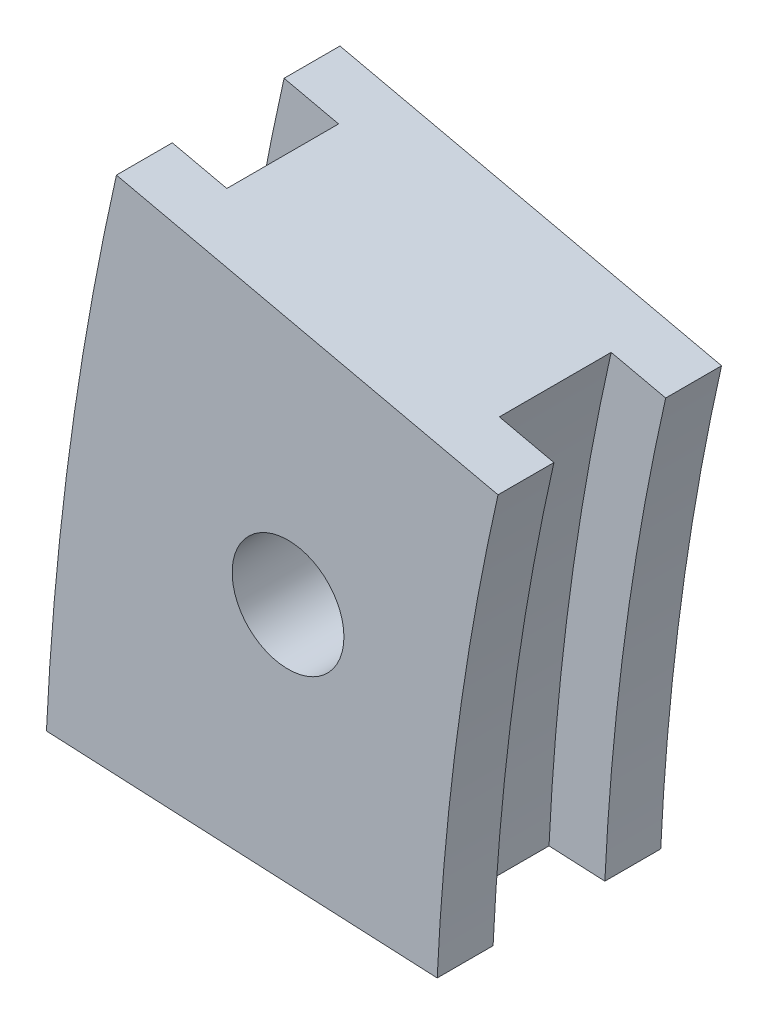
ISO-10303-21;
HEADER;
FILE_DESCRIPTION(('STEP AP214'),'2;1');
FILE_NAME('part.step','',(''),(''),'','','');
FILE_SCHEMA(('AUTOMOTIVE_DESIGN { 1 0 10303 214 1 1 1 1 }'));
ENDSEC;
DATA;
#1=APPLICATION_CONTEXT('core data for automotive mechanical design processes');
#2=APPLICATION_PROTOCOL_DEFINITION('international standard','automotive_design',2000,#1);
#3=PRODUCT_CONTEXT('',#1,'mechanical');
#4=PRODUCT('Part','Part','',(#3));
#5=PRODUCT_RELATED_PRODUCT_CATEGORY('part','',(#4));
#6=PRODUCT_DEFINITION_FORMATION('','',#4);
#7=PRODUCT_DEFINITION_CONTEXT('part definition',#1,'design');
#8=PRODUCT_DEFINITION('design','',#6,#7);
#9=PRODUCT_DEFINITION_SHAPE('','',#8);
#10=(LENGTH_UNIT() NAMED_UNIT(*) SI_UNIT(.MILLI.,.METRE.));
#11=(NAMED_UNIT(*) PLANE_ANGLE_UNIT() SI_UNIT($,.RADIAN.));
#12=(NAMED_UNIT(*) SI_UNIT($,.STERADIAN.) SOLID_ANGLE_UNIT());
#13=UNCERTAINTY_MEASURE_WITH_UNIT(LENGTH_MEASURE(1.E-05),#10,'distance_accuracy_value','');
#14=(GEOMETRIC_REPRESENTATION_CONTEXT(3) GLOBAL_UNCERTAINTY_ASSIGNED_CONTEXT((#13)) GLOBAL_UNIT_ASSIGNED_CONTEXT((#10,
#11,#12)) REPRESENTATION_CONTEXT('',''));
#15=CARTESIAN_POINT('',(0.,0.,0.));
#16=DIRECTION('',(0.,0.,1.));
#17=DIRECTION('',(1.,0.,0.));
#18=AXIS2_PLACEMENT_3D('',#15,#16,#17);
#19=CARTESIAN_POINT('',(0.,0.,4.));
#20=DIRECTION('',(0.,0.,-1.));
#21=DIRECTION('',(-1.,0.,0.));
#22=AXIS2_PLACEMENT_3D('',#19,#20,#21);
#23=CYLINDRICAL_SURFACE('',#22,93.);
#24=CARTESIAN_POINT('',(0.,0.,-2.));
#25=DIRECTION('',(0.,0.,1.));
#26=DIRECTION('',(1.,0.,0.));
#27=AXIS2_PLACEMENT_3D('',#24,#25,#26);
#28=CIRCLE('',#27,93.);
#29=CARTESIAN_POINT('',(-92.8954467947478,4.40862391276168,-2.));
#30=VERTEX_POINT('',#29);
#31=CARTESIAN_POINT('',(-90.7186067145308,20.4727720588661,-2.));
#32=VERTEX_POINT('',#31);
#33=EDGE_CURVE('E46',#30,#32,#28,.F.);
#34=ORIENTED_EDGE('',*,*,#33,.F.);
#35=DIRECTION('',(0.,0.,-1.));
#36=VECTOR('',#35,1.);
#37=CARTESIAN_POINT('',(-92.8954467947478,4.40862391276169,4.));
#38=LINE('',#37,#36);
#39=CARTESIAN_POINT('',(-92.8954467947478,4.40862391276169,-4.));
#40=VERTEX_POINT('',#39);
#41=EDGE_CURVE('E197',#30,#40,#38,.T.);
#42=ORIENTED_EDGE('',*,*,#41,.T.);
#43=CARTESIAN_POINT('',(0.,0.,-4.));
#44=DIRECTION('',(0.,0.,-1.));
#45=DIRECTION('',(1.,0.,0.));
#46=AXIS2_PLACEMENT_3D('',#43,#44,#45);
#47=CIRCLE('',#46,93.);
#48=CARTESIAN_POINT('',(-90.7186067145308,20.4727720588661,-4.));
#49=VERTEX_POINT('',#48);
#50=EDGE_CURVE('E186',#40,#49,#47,.T.);
#51=ORIENTED_EDGE('',*,*,#50,.T.);
#52=DIRECTION('',(0.,0.,-1.));
#53=VECTOR('',#52,1.);
#54=CARTESIAN_POINT('',(-90.7186067145308,20.4727720588661,4.));
#55=LINE('',#54,#53);
#56=EDGE_CURVE('E194',#32,#49,#55,.T.);
#57=ORIENTED_EDGE('',*,*,#56,.F.);
#58=EDGE_LOOP('',(#34,#42,#51,#57));
#59=FACE_BOUND('',#58,.T.);
#60=ADVANCED_FACE('F31',(#59),#23,.F.);
#61=CARTESIAN_POINT('',(0.,0.,4.));
#62=DIRECTION('',(0.,0.,-1.));
#63=DIRECTION('',(-1.,0.,0.));
#64=AXIS2_PLACEMENT_3D('',#61,#62,#63);
#65=CYLINDRICAL_SURFACE('',#64,107.);
#66=CARTESIAN_POINT('',(0.,0.,-2.));
#67=DIRECTION('',(0.,0.,1.));
#68=DIRECTION('',(1.,0.,0.));
#69=AXIS2_PLACEMENT_3D('',#66,#67,#68);
#70=CIRCLE('',#69,107.);
#71=CARTESIAN_POINT('',(-104.375171166181,23.5546947343943,-2.));
#72=VERTEX_POINT('',#71);
#73=CARTESIAN_POINT('',(-106.879707602559,5.07228772758602,-2.));
#74=VERTEX_POINT('',#73);
#75=EDGE_CURVE('E146',#72,#74,#70,.T.);
#76=ORIENTED_EDGE('',*,*,#75,.F.);
#77=DIRECTION('',(0.,0.,-1.));
#78=VECTOR('',#77,1.);
#79=CARTESIAN_POINT('',(-104.375171166181,23.5546947343943,4.));
#80=LINE('',#79,#78);
#81=CARTESIAN_POINT('',(-104.375171166181,23.5546947343943,-4.));
#82=VERTEX_POINT('',#81);
#83=EDGE_CURVE('E180',#72,#82,#80,.T.);
#84=ORIENTED_EDGE('',*,*,#83,.T.);
#85=CARTESIAN_POINT('',(0.,0.,-4.));
#86=DIRECTION('',(0.,0.,1.));
#87=DIRECTION('',(1.,0.,0.));
#88=AXIS2_PLACEMENT_3D('',#85,#86,#87);
#89=CIRCLE('',#88,107.);
#90=CARTESIAN_POINT('',(-106.879707602559,5.07228772758602,-4.));
#91=VERTEX_POINT('',#90);
#92=EDGE_CURVE('E169',#82,#91,#89,.T.);
#93=ORIENTED_EDGE('',*,*,#92,.T.);
#94=DIRECTION('',(0.,0.,-1.));
#95=VECTOR('',#94,1.);
#96=CARTESIAN_POINT('',(-106.879707602559,5.07228772758602,4.));
#97=LINE('',#96,#95);
#98=EDGE_CURVE('E201',#74,#91,#97,.T.);
#99=ORIENTED_EDGE('',*,*,#98,.F.);
#100=EDGE_LOOP('',(#76,#84,#93,#99));
#101=FACE_BOUND('',#100,.T.);
#102=ADVANCED_FACE('F217',(#101),#65,.T.);
#103=CARTESIAN_POINT('',(-104.375171166181,23.5546947343943,4.));
#104=VERTEX_POINT('',#103);
#105=CARTESIAN_POINT('',(-104.375171166181,23.5546947343943,2.));
#106=VERTEX_POINT('',#105);
#107=EDGE_CURVE('E191',#104,#106,#80,.T.);
#108=ORIENTED_EDGE('',*,*,#107,.T.);
#109=CARTESIAN_POINT('',(0.,0.,2.));
#110=DIRECTION('',(0.,0.,1.));
#111=DIRECTION('',(1.,0.,0.));
#112=AXIS2_PLACEMENT_3D('',#109,#110,#111);
#113=CIRCLE('',#112,107.);
#114=CARTESIAN_POINT('',(-106.879707602559,5.07228772758602,2.));
#115=VERTEX_POINT('',#114);
#116=EDGE_CURVE('E153',#106,#115,#113,.T.);
#117=ORIENTED_EDGE('',*,*,#116,.T.);
#118=CARTESIAN_POINT('',(-106.879707602559,5.07228772758602,4.));
#119=VERTEX_POINT('',#118);
#120=EDGE_CURVE('E125',#119,#115,#97,.T.);
#121=ORIENTED_EDGE('',*,*,#120,.F.);
#122=CARTESIAN_POINT('',(0.,0.,4.));
#123=DIRECTION('',(0.,0.,1.));
#124=DIRECTION('',(1.,0.,0.));
#125=AXIS2_PLACEMENT_3D('',#122,#123,#124);
#126=CIRCLE('',#125,107.);
#127=EDGE_CURVE('E170',#104,#119,#126,.T.);
#128=ORIENTED_EDGE('',*,*,#127,.F.);
#129=EDGE_LOOP('',(#108,#117,#121,#128));
#130=FACE_BOUND('',#129,.T.);
#131=ADVANCED_FACE('F33',(#130),#65,.T.);
#132=CARTESIAN_POINT('',(-92.8954467947478,4.40862391276168,4.));
#133=DIRECTION('',(0.0474045582017385,0.998875771986536,0.));
#134=DIRECTION('',(-0.998875771986536,0.0474045582017385,0.));
#135=AXIS2_PLACEMENT_3D('',#132,#133,#134);
#136=PLANE('',#135);
#137=DIRECTION('',(0.,0.,-1.));
#138=VECTOR('',#137,1.);
#139=CARTESIAN_POINT('',(-94.8931983387209,4.50343302916516,2.));
#140=LINE('',#139,#138);
#141=CARTESIAN_POINT('',(-94.8931983387209,4.50343302916516,2.));
#142=VERTEX_POINT('',#141);
#143=CARTESIAN_POINT('',(-94.8931983387209,4.50343302916516,-2.));
#144=VERTEX_POINT('',#143);
#145=EDGE_CURVE('E131',#142,#144,#140,.T.);
#146=ORIENTED_EDGE('',*,*,#145,.F.);
#147=DIRECTION('',(0.998875771986536,-0.0474045582017385,0.));
#148=VECTOR('',#147,1.);
#149=CARTESIAN_POINT('',(-81.9921139469227,3.89117450506435,2.));
#150=LINE('',#149,#148);
#151=CARTESIAN_POINT('',(-92.8954467947478,4.40862391276168,2.));
#152=VERTEX_POINT('',#151);
#153=EDGE_CURVE('E140',#142,#152,#150,.T.);
#154=ORIENTED_EDGE('',*,*,#153,.T.);
#155=CARTESIAN_POINT('',(-92.8954467947478,4.40862391276169,4.));
#156=VERTEX_POINT('',#155);
#157=EDGE_CURVE('E198',#156,#152,#38,.T.);
#158=ORIENTED_EDGE('',*,*,#157,.F.);
#159=DIRECTION('',(0.998875771986536,-0.0474045582017385,0.));
#160=VECTOR('',#159,1.);
#161=CARTESIAN_POINT('',(-92.8954467947478,4.40862391276168,4.));
#162=LINE('',#161,#160);
#163=EDGE_CURVE('E173',#119,#156,#162,.T.);
#164=ORIENTED_EDGE('',*,*,#163,.F.);
#165=ORIENTED_EDGE('',*,*,#120,.T.);
#166=DIRECTION('',(0.998875771986536,-0.0474045582017385,0.));
#167=VECTOR('',#166,1.);
#168=CARTESIAN_POINT('',(-104.881956058586,4.97747861118255,2.));
#169=LINE('',#168,#167);
#170=CARTESIAN_POINT('',(-104.881956058586,4.97747861118256,2.));
#171=VERTEX_POINT('',#170);
#172=EDGE_CURVE('E156',#115,#171,#169,.T.);
#173=ORIENTED_EDGE('',*,*,#172,.T.);
#174=DIRECTION('',(0.,0.,-1.));
#175=VECTOR('',#174,1.);
#176=CARTESIAN_POINT('',(-104.881956058586,4.97747861118256,2.));
#177=LINE('',#176,#175);
#178=CARTESIAN_POINT('',(-104.881956058586,4.97747861118256,-2.));
#179=VERTEX_POINT('',#178);
#180=EDGE_CURVE('E166',#171,#179,#177,.T.);
#181=ORIENTED_EDGE('',*,*,#180,.T.);
#182=DIRECTION('',(0.998875771986536,-0.0474045582017385,0.));
#183=VECTOR('',#182,1.);
#184=CARTESIAN_POINT('',(-104.881956058586,4.97747861118255,-2.));
#185=LINE('',#184,#183);
#186=EDGE_CURVE('E148',#74,#179,#185,.T.);
#187=ORIENTED_EDGE('',*,*,#186,.F.);
#188=ORIENTED_EDGE('',*,*,#98,.T.);
#189=DIRECTION('',(0.998875771986536,-0.0474045582017385,0.));
#190=VECTOR('',#189,1.);
#191=CARTESIAN_POINT('',(-92.8954467947478,4.40862391276168,-4.));
#192=LINE('',#191,#190);
#193=EDGE_CURVE('E183',#91,#40,#192,.T.);
#194=ORIENTED_EDGE('',*,*,#193,.T.);
#195=ORIENTED_EDGE('',*,*,#41,.F.);
#196=DIRECTION('',(0.998875771986536,-0.0474045582017385,0.));
#197=VECTOR('',#196,1.);
#198=CARTESIAN_POINT('',(-81.9921139469227,3.89117450506435,-2.));
#199=LINE('',#198,#197);
#200=EDGE_CURVE('E132',#144,#30,#199,.T.);
#201=ORIENTED_EDGE('',*,*,#200,.F.);
#202=EDGE_LOOP('',(#146,#154,#158,#164,#165,#173,#181,#187,#188,#194,#195,#201));
#203=FACE_BOUND('',#202,.T.);
#204=ADVANCED_FACE('F208',(#203),#136,.F.);
#205=ORIENTED_EDGE('',*,*,#157,.T.);
#206=CARTESIAN_POINT('',(0.,0.,2.));
#207=DIRECTION('',(0.,0.,1.));
#208=DIRECTION('',(1.,0.,0.));
#209=AXIS2_PLACEMENT_3D('',#206,#207,#208);
#210=CIRCLE('',#209,93.);
#211=CARTESIAN_POINT('',(-90.7186067145308,20.4727720588661,2.));
#212=VERTEX_POINT('',#211);
#213=EDGE_CURVE('E138',#152,#212,#210,.F.);
#214=ORIENTED_EDGE('',*,*,#213,.T.);
#215=CARTESIAN_POINT('',(-90.7186067145308,20.4727720588661,4.));
#216=VERTEX_POINT('',#215);
#217=EDGE_CURVE('E195',#216,#212,#55,.T.);
#218=ORIENTED_EDGE('',*,*,#217,.F.);
#219=CARTESIAN_POINT('',(0.,0.,4.));
#220=DIRECTION('',(0.,0.,-1.));
#221=DIRECTION('',(1.,0.,0.));
#222=AXIS2_PLACEMENT_3D('',#219,#220,#221);
#223=CIRCLE('',#222,93.);
#224=EDGE_CURVE('E176',#156,#216,#223,.T.);
#225=ORIENTED_EDGE('',*,*,#224,.F.);
#226=EDGE_LOOP('',(#205,#214,#218,#225));
#227=FACE_BOUND('',#226,.T.);
#228=ADVANCED_FACE('F231',(#227),#23,.F.);
#229=CARTESIAN_POINT('',(-90.7186067145308,20.4727720588661,4.));
#230=DIRECTION('',(-0.220137333966302,-0.975468889403557,0.));
#231=DIRECTION('',(0.975468889403557,-0.220137333966302,0.));
#232=AXIS2_PLACEMENT_3D('',#229,#230,#231);
#233=PLANE('',#232);
#234=ORIENTED_EDGE('',*,*,#217,.T.);
#235=DIRECTION('',(-0.975468889403557,0.220137333966302,0.));
#236=VECTOR('',#235,1.);
#237=CARTESIAN_POINT('',(-90.7186067145308,20.4727720588661,2.));
#238=LINE('',#237,#236);
#239=CARTESIAN_POINT('',(-92.6695444933379,20.9130467267986,2.));
#240=VERTEX_POINT('',#239);
#241=EDGE_CURVE('E11',#212,#240,#238,.T.);
#242=ORIENTED_EDGE('',*,*,#241,.T.);
#243=DIRECTION('',(0.,0.,-1.));
#244=VECTOR('',#243,1.);
#245=CARTESIAN_POINT('',(-92.6695444933379,20.9130467267986,2.));
#246=LINE('',#245,#244);
#247=CARTESIAN_POINT('',(-92.6695444933379,20.9130467267986,-2.));
#248=VERTEX_POINT('',#247);
#249=EDGE_CURVE('E128',#240,#248,#246,.T.);
#250=ORIENTED_EDGE('',*,*,#249,.T.);
#251=DIRECTION('',(-0.975468889403557,0.220137333966302,0.));
#252=VECTOR('',#251,1.);
#253=CARTESIAN_POINT('',(-90.7186067145308,20.4727720588661,-2.));
#254=LINE('',#253,#252);
#255=EDGE_CURVE('E39',#32,#248,#254,.T.);
#256=ORIENTED_EDGE('',*,*,#255,.F.);
#257=ORIENTED_EDGE('',*,*,#56,.T.);
#258=DIRECTION('',(-0.975468889403557,0.220137333966302,0.));
#259=VECTOR('',#258,1.);
#260=CARTESIAN_POINT('',(-90.7186067145308,20.4727720588661,-4.));
#261=LINE('',#260,#259);
#262=EDGE_CURVE('E174',#49,#82,#261,.T.);
#263=ORIENTED_EDGE('',*,*,#262,.T.);
#264=ORIENTED_EDGE('',*,*,#83,.F.);
#265=DIRECTION('',(-0.975468889403557,0.220137333966301,0.));
#266=VECTOR('',#265,1.);
#267=CARTESIAN_POINT('',(-102.424233387373,23.1144200664617,-2.));
#268=LINE('',#267,#266);
#269=CARTESIAN_POINT('',(-102.424233387373,23.1144200664617,-2.));
#270=VERTEX_POINT('',#269);
#271=EDGE_CURVE('E151',#270,#72,#268,.T.);
#272=ORIENTED_EDGE('',*,*,#271,.F.);
#273=DIRECTION('',(0.,0.,-1.));
#274=VECTOR('',#273,1.);
#275=CARTESIAN_POINT('',(-102.424233387373,23.1144200664617,2.));
#276=LINE('',#275,#274);
#277=CARTESIAN_POINT('',(-102.424233387373,23.1144200664617,2.));
#278=VERTEX_POINT('',#277);
#279=EDGE_CURVE('E164',#278,#270,#276,.T.);
#280=ORIENTED_EDGE('',*,*,#279,.F.);
#281=DIRECTION('',(-0.975468889403557,0.220137333966301,0.));
#282=VECTOR('',#281,1.);
#283=CARTESIAN_POINT('',(-102.424233387373,23.1144200664617,2.));
#284=LINE('',#283,#282);
#285=EDGE_CURVE('E161',#278,#106,#284,.T.);
#286=ORIENTED_EDGE('',*,*,#285,.T.);
#287=ORIENTED_EDGE('',*,*,#107,.F.);
#288=DIRECTION('',(-0.975468889403557,0.220137333966302,0.));
#289=VECTOR('',#288,1.);
#290=CARTESIAN_POINT('',(-90.7186067145308,20.4727720588661,4.));
#291=LINE('',#290,#289);
#292=EDGE_CURVE('E178',#216,#104,#291,.T.);
#293=ORIENTED_EDGE('',*,*,#292,.F.);
#294=EDGE_LOOP('',(#234,#242,#250,#256,#257,#263,#264,#272,#280,#286,#287,#293));
#295=FACE_BOUND('',#294,.T.);
#296=ADVANCED_FACE('F136',(#295),#233,.F.);
#297=CARTESIAN_POINT('',(0.,0.,4.));
#298=DIRECTION('',(0.,0.,1.));
#299=DIRECTION('',(1.,0.,0.));
#300=AXIS2_PLACEMENT_3D('',#297,#298,#299);
#301=PLANE('',#300);
#302=CARTESIAN_POINT('',(-98.2335186274641,13.3115468448208,4.));
#303=DIRECTION('',(0.,0.,1.));
#304=DIRECTION('',(1.,0.,0.));
#305=AXIS2_PLACEMENT_3D('',#302,#303,#304);
#306=CIRCLE('',#305,2.);
#307=CARTESIAN_POINT('',(-96.2335186274641,13.3115468448208,4.));
#308=VERTEX_POINT('',#307);
#309=EDGE_CURVE('E365',#308,#308,#306,.T.);
#310=ORIENTED_EDGE('',*,*,#309,.F.);
#311=EDGE_LOOP('',(#310));
#312=FACE_BOUND('',#311,.T.);
#313=ORIENTED_EDGE('',*,*,#127,.T.);
#314=ORIENTED_EDGE('',*,*,#163,.T.);
#315=ORIENTED_EDGE('',*,*,#224,.T.);
#316=ORIENTED_EDGE('',*,*,#292,.T.);
#317=EDGE_LOOP('',(#313,#314,#315,#316));
#318=FACE_BOUND('',#317,.T.);
#319=ADVANCED_FACE('F235',(#312,#318),#301,.T.);
#320=CARTESIAN_POINT('',(0.,0.,-4.));
#321=DIRECTION('',(0.,0.,1.));
#322=DIRECTION('',(1.,0.,0.));
#323=AXIS2_PLACEMENT_3D('',#320,#321,#322);
#324=PLANE('',#323);
#325=CARTESIAN_POINT('',(-98.2335186274641,13.3115468448208,-4.));
#326=DIRECTION('',(0.,0.,1.));
#327=DIRECTION('',(1.,0.,0.));
#328=AXIS2_PLACEMENT_3D('',#325,#326,#327);
#329=CIRCLE('',#328,2.);
#330=CARTESIAN_POINT('',(-96.2335186274641,13.3115468448208,-4.));
#331=VERTEX_POINT('',#330);
#332=EDGE_CURVE('E133',#331,#331,#329,.T.);
#333=ORIENTED_EDGE('',*,*,#332,.T.);
#334=EDGE_LOOP('',(#333));
#335=FACE_BOUND('',#334,.T.);
#336=ORIENTED_EDGE('',*,*,#92,.F.);
#337=ORIENTED_EDGE('',*,*,#262,.F.);
#338=ORIENTED_EDGE('',*,*,#50,.F.);
#339=ORIENTED_EDGE('',*,*,#193,.F.);
#340=EDGE_LOOP('',(#336,#337,#338,#339));
#341=FACE_BOUND('',#340,.T.);
#342=ADVANCED_FACE('F215',(#335,#341),#324,.F.);
#343=CARTESIAN_POINT('',(0.,0.,2.));
#344=DIRECTION('',(0.,0.,-1.));
#345=DIRECTION('',(-1.,0.,0.));
#346=AXIS2_PLACEMENT_3D('',#343,#344,#345);
#347=CYLINDRICAL_SURFACE('',#346,105.);
#348=ORIENTED_EDGE('',*,*,#180,.F.);
#349=CARTESIAN_POINT('',(0.,0.,2.));
#350=DIRECTION('',(0.,0.,-1.));
#351=DIRECTION('',(1.,0.,0.));
#352=AXIS2_PLACEMENT_3D('',#349,#350,#351);
#353=CIRCLE('',#352,105.);
#354=EDGE_CURVE('E159',#171,#278,#353,.T.);
#355=ORIENTED_EDGE('',*,*,#354,.T.);
#356=ORIENTED_EDGE('',*,*,#279,.T.);
#357=CARTESIAN_POINT('',(0.,0.,-2.));
#358=DIRECTION('',(0.,0.,-1.));
#359=DIRECTION('',(1.,0.,0.));
#360=AXIS2_PLACEMENT_3D('',#357,#358,#359);
#361=CIRCLE('',#360,105.);
#362=EDGE_CURVE('E54',#179,#270,#361,.T.);
#363=ORIENTED_EDGE('',*,*,#362,.F.);
#364=EDGE_LOOP('',(#348,#355,#356,#363));
#365=FACE_BOUND('',#364,.T.);
#366=ADVANCED_FACE('F245',(#365),#347,.T.);
#367=CARTESIAN_POINT('',(0.,0.,2.));
#368=DIRECTION('',(0.,0.,1.));
#369=DIRECTION('',(1.,0.,0.));
#370=AXIS2_PLACEMENT_3D('',#367,#368,#369);
#371=PLANE('',#370);
#372=ORIENTED_EDGE('',*,*,#116,.F.);
#373=ORIENTED_EDGE('',*,*,#285,.F.);
#374=ORIENTED_EDGE('',*,*,#354,.F.);
#375=ORIENTED_EDGE('',*,*,#172,.F.);
#376=EDGE_LOOP('',(#372,#373,#374,#375));
#377=FACE_BOUND('',#376,.T.);
#378=ADVANCED_FACE('F241',(#377),#371,.F.);
#379=CARTESIAN_POINT('',(0.,0.,-2.));
#380=DIRECTION('',(0.,0.,1.));
#381=DIRECTION('',(1.,0.,0.));
#382=AXIS2_PLACEMENT_3D('',#379,#380,#381);
#383=PLANE('',#382);
#384=ORIENTED_EDGE('',*,*,#75,.T.);
#385=ORIENTED_EDGE('',*,*,#186,.T.);
#386=ORIENTED_EDGE('',*,*,#362,.T.);
#387=ORIENTED_EDGE('',*,*,#271,.T.);
#388=EDGE_LOOP('',(#384,#385,#386,#387));
#389=FACE_BOUND('',#388,.T.);
#390=ADVANCED_FACE('F246',(#389),#383,.T.);
#391=CARTESIAN_POINT('',(0.,0.,2.));
#392=DIRECTION('',(0.,0.,1.));
#393=DIRECTION('',(1.,0.,0.));
#394=AXIS2_PLACEMENT_3D('',#391,#392,#393);
#395=PLANE('',#394);
#396=ORIENTED_EDGE('',*,*,#153,.F.);
#397=CARTESIAN_POINT('',(0.,0.,2.));
#398=DIRECTION('',(0.,0.,1.));
#399=DIRECTION('',(1.,0.,0.));
#400=AXIS2_PLACEMENT_3D('',#397,#398,#399);
#401=CIRCLE('',#400,95.);
#402=EDGE_CURVE('E222',#240,#142,#401,.T.);
#403=ORIENTED_EDGE('',*,*,#402,.F.);
#404=ORIENTED_EDGE('',*,*,#241,.F.);
#405=ORIENTED_EDGE('',*,*,#213,.F.);
#406=EDGE_LOOP('',(#396,#403,#404,#405));
#407=FACE_BOUND('',#406,.T.);
#408=ADVANCED_FACE('F248',(#407),#395,.F.);
#409=CARTESIAN_POINT('',(0.,0.,-2.));
#410=DIRECTION('',(0.,0.,1.));
#411=DIRECTION('',(1.,0.,0.));
#412=AXIS2_PLACEMENT_3D('',#409,#410,#411);
#413=PLANE('',#412);
#414=ORIENTED_EDGE('',*,*,#33,.T.);
#415=ORIENTED_EDGE('',*,*,#255,.T.);
#416=CARTESIAN_POINT('',(0.,0.,-2.));
#417=DIRECTION('',(0.,0.,1.));
#418=DIRECTION('',(1.,0.,0.));
#419=AXIS2_PLACEMENT_3D('',#416,#417,#418);
#420=CIRCLE('',#419,95.);
#421=EDGE_CURVE('E120',#248,#144,#420,.T.);
#422=ORIENTED_EDGE('',*,*,#421,.T.);
#423=ORIENTED_EDGE('',*,*,#200,.T.);
#424=EDGE_LOOP('',(#414,#415,#422,#423));
#425=FACE_BOUND('',#424,.T.);
#426=ADVANCED_FACE('F119',(#425),#413,.T.);
#427=CARTESIAN_POINT('',(0.,0.,2.));
#428=DIRECTION('',(0.,0.,-1.));
#429=DIRECTION('',(-1.,0.,0.));
#430=AXIS2_PLACEMENT_3D('',#427,#428,#429);
#431=CYLINDRICAL_SURFACE('',#430,95.);
#432=ORIENTED_EDGE('',*,*,#249,.F.);
#433=ORIENTED_EDGE('',*,*,#402,.T.);
#434=ORIENTED_EDGE('',*,*,#145,.T.);
#435=ORIENTED_EDGE('',*,*,#421,.F.);
#436=EDGE_LOOP('',(#432,#433,#434,#435));
#437=FACE_BOUND('',#436,.T.);
#438=ADVANCED_FACE('F127',(#437),#431,.F.);
#439=CARTESIAN_POINT('',(-98.2335186274641,13.3115468448208,-4.));
#440=DIRECTION('',(0.,0.,1.));
#441=DIRECTION('',(1.,0.,0.));
#442=AXIS2_PLACEMENT_3D('',#439,#440,#441);
#443=CYLINDRICAL_SURFACE('',#442,2.);
#444=ORIENTED_EDGE('',*,*,#332,.F.);
#445=EDGE_LOOP('',(#444));
#446=FACE_BOUND('',#445,.T.);
#447=ORIENTED_EDGE('',*,*,#309,.T.);
#448=EDGE_LOOP('',(#447));
#449=FACE_BOUND('',#448,.T.);
#450=ADVANCED_FACE('F321',(#446,#449),#443,.F.);
#451=CLOSED_SHELL('',(#60,#102,#131,#204,#228,#296,#319,#342,#366,#378,#390,#408,#426,#438,#450));
#452=MANIFOLD_SOLID_BREP('B2',#451);
#453=ADVANCED_BREP_SHAPE_REPRESENTATION('',(#18,#452),#14);
#454=SHAPE_DEFINITION_REPRESENTATION(#9,#453);
ENDSEC;
END-ISO-10303-21;
